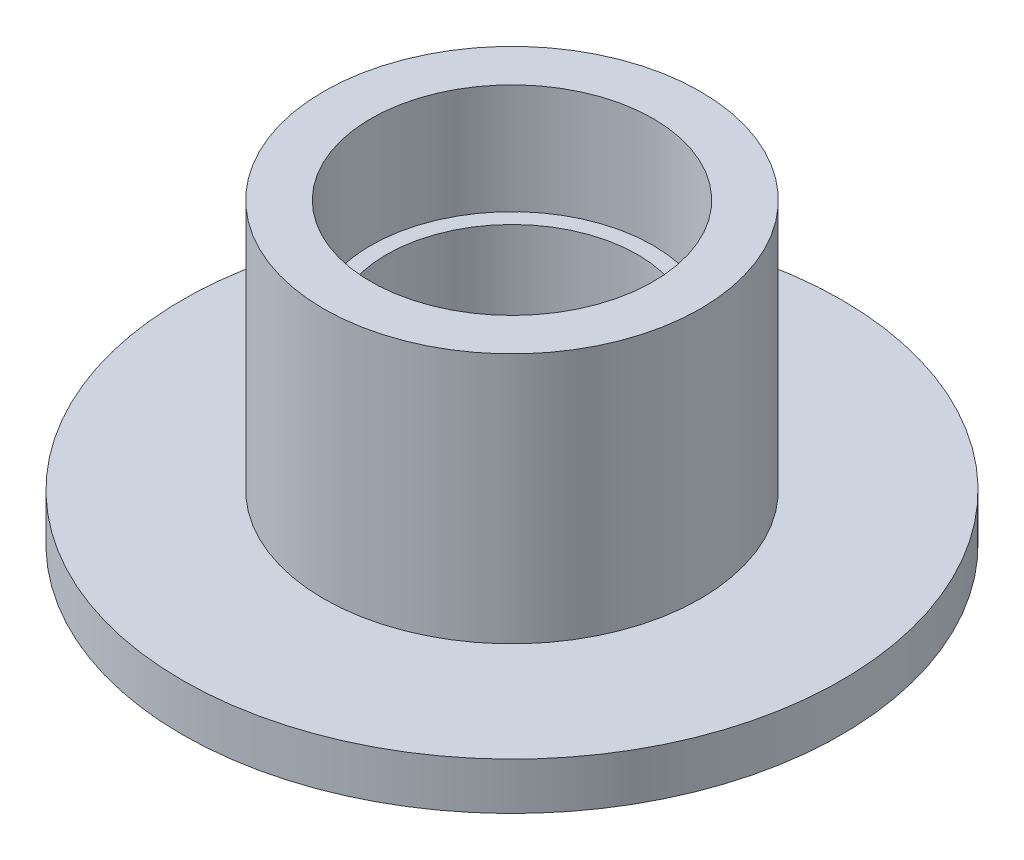
ISO-10303-21;
HEADER;
FILE_DESCRIPTION(('STEP AP214'),'2;1');
FILE_NAME('part.step','',(''),(''),'','','');
FILE_SCHEMA(('AUTOMOTIVE_DESIGN { 1 0 10303 214 1 1 1 1 }'));
ENDSEC;
DATA;
#1=APPLICATION_CONTEXT('core data for automotive mechanical design processes');
#2=APPLICATION_PROTOCOL_DEFINITION('international standard','automotive_design',2000,#1);
#3=PRODUCT_CONTEXT('',#1,'mechanical');
#4=PRODUCT('Part','Part','',(#3));
#5=PRODUCT_RELATED_PRODUCT_CATEGORY('part','',(#4));
#6=PRODUCT_DEFINITION_FORMATION('','',#4);
#7=PRODUCT_DEFINITION_CONTEXT('part definition',#1,'design');
#8=PRODUCT_DEFINITION('design','',#6,#7);
#9=PRODUCT_DEFINITION_SHAPE('','',#8);
#10=(LENGTH_UNIT() NAMED_UNIT(*) SI_UNIT(.MILLI.,.METRE.));
#11=(NAMED_UNIT(*) PLANE_ANGLE_UNIT() SI_UNIT($,.RADIAN.));
#12=(NAMED_UNIT(*) SI_UNIT($,.STERADIAN.) SOLID_ANGLE_UNIT());
#13=UNCERTAINTY_MEASURE_WITH_UNIT(LENGTH_MEASURE(1.E-05),#10,'distance_accuracy_value','');
#14=(GEOMETRIC_REPRESENTATION_CONTEXT(3) GLOBAL_UNCERTAINTY_ASSIGNED_CONTEXT((#13)) GLOBAL_UNIT_ASSIGNED_CONTEXT((#10,
#11,#12)) REPRESENTATION_CONTEXT('',''));
#15=CARTESIAN_POINT('',(0.,0.,0.));
#16=DIRECTION('',(0.,0.,1.));
#17=DIRECTION('',(1.,0.,0.));
#18=AXIS2_PLACEMENT_3D('',#15,#16,#17);
#19=CARTESIAN_POINT('',(-2.,0.,0.));
#20=DIRECTION('',(0.,1.,0.));
#21=DIRECTION('',(0.,0.,1.));
#22=AXIS2_PLACEMENT_3D('',#19,#20,#21);
#23=PLANE('',#22);
#24=CARTESIAN_POINT('',(0.,0.,0.));
#25=DIRECTION('',(0.,-1.,0.));
#26=DIRECTION('',(0.,0.,-1.));
#27=AXIS2_PLACEMENT_3D('',#24,#25,#26);
#28=CIRCLE('',#27,2.);
#29=CARTESIAN_POINT('',(0.,0.,-2.));
#30=VERTEX_POINT('',#29);
#31=EDGE_CURVE('E71',#30,#30,#28,.T.);
#32=ORIENTED_EDGE('',*,*,#31,.F.);
#33=EDGE_LOOP('',(#32));
#34=FACE_BOUND('',#33,.T.);
#35=CARTESIAN_POINT('',(0.,0.,0.));
#36=DIRECTION('',(0.,-1.,0.));
#37=DIRECTION('',(0.,0.,-1.));
#38=AXIS2_PLACEMENT_3D('',#35,#36,#37);
#39=CIRCLE('',#38,3.);
#40=CARTESIAN_POINT('',(0.,0.,-3.));
#41=VERTEX_POINT('',#40);
#42=EDGE_CURVE('E10',#41,#41,#39,.T.);
#43=ORIENTED_EDGE('',*,*,#42,.T.);
#44=EDGE_LOOP('',(#43));
#45=FACE_BOUND('',#44,.T.);
#46=ADVANCED_FACE('F31',(#34,#45),#23,.F.);
#47=CARTESIAN_POINT('',(0.,0.,0.));
#48=DIRECTION('',(0.,-1.,0.));
#49=DIRECTION('',(0.,0.,-1.));
#50=AXIS2_PLACEMENT_3D('',#47,#48,#49);
#51=CYLINDRICAL_SURFACE('',#50,3.);
#52=ORIENTED_EDGE('',*,*,#42,.F.);
#53=EDGE_LOOP('',(#52));
#54=FACE_BOUND('',#53,.T.);
#55=CARTESIAN_POINT('',(0.,3.,0.));
#56=DIRECTION('',(0.,-1.,0.));
#57=DIRECTION('',(0.,0.,-1.));
#58=AXIS2_PLACEMENT_3D('',#55,#56,#57);
#59=CIRCLE('',#58,3.);
#60=CARTESIAN_POINT('',(0.,3.,-3.));
#61=VERTEX_POINT('',#60);
#62=EDGE_CURVE('E37',#61,#61,#59,.T.);
#63=ORIENTED_EDGE('',*,*,#62,.T.);
#64=EDGE_LOOP('',(#63));
#65=FACE_BOUND('',#64,.T.);
#66=ADVANCED_FACE('F78',(#54,#65),#51,.T.);
#67=CARTESIAN_POINT('',(-3.,3.,0.));
#68=DIRECTION('',(0.,1.,0.));
#69=DIRECTION('',(0.,0.,1.));
#70=AXIS2_PLACEMENT_3D('',#67,#68,#69);
#71=PLANE('',#70);
#72=ORIENTED_EDGE('',*,*,#62,.F.);
#73=EDGE_LOOP('',(#72));
#74=FACE_BOUND('',#73,.T.);
#75=CARTESIAN_POINT('',(0.,3.,0.));
#76=DIRECTION('',(0.,-1.,0.));
#77=DIRECTION('',(0.,0.,-1.));
#78=AXIS2_PLACEMENT_3D('',#75,#76,#77);
#79=CIRCLE('',#78,10.5);
#80=CARTESIAN_POINT('',(0.,3.,-10.5));
#81=VERTEX_POINT('',#80);
#82=EDGE_CURVE('E41',#81,#81,#79,.T.);
#83=ORIENTED_EDGE('',*,*,#82,.T.);
#84=EDGE_LOOP('',(#83));
#85=FACE_BOUND('',#84,.T.);
#86=ADVANCED_FACE('F82',(#74,#85),#71,.F.);
#87=CARTESIAN_POINT('',(0.,0.,0.));
#88=DIRECTION('',(0.,-1.,0.));
#89=DIRECTION('',(0.,0.,-1.));
#90=AXIS2_PLACEMENT_3D('',#87,#88,#89);
#91=CYLINDRICAL_SURFACE('',#90,10.5);
#92=ORIENTED_EDGE('',*,*,#82,.F.);
#93=EDGE_LOOP('',(#92));
#94=FACE_BOUND('',#93,.T.);
#95=CARTESIAN_POINT('',(0.,4.5,0.));
#96=DIRECTION('',(0.,-1.,0.));
#97=DIRECTION('',(0.,0.,-1.));
#98=AXIS2_PLACEMENT_3D('',#95,#96,#97);
#99=CIRCLE('',#98,10.5);
#100=CARTESIAN_POINT('',(0.,4.5,-10.5));
#101=VERTEX_POINT('',#100);
#102=EDGE_CURVE('E45',#101,#101,#99,.T.);
#103=ORIENTED_EDGE('',*,*,#102,.T.);
#104=EDGE_LOOP('',(#103));
#105=FACE_BOUND('',#104,.T.);
#106=ADVANCED_FACE('F87',(#94,#105),#91,.T.);
#107=CARTESIAN_POINT('',(-10.5,4.5,0.));
#108=DIRECTION('',(0.,-1.,0.));
#109=DIRECTION('',(0.,0.,-1.));
#110=AXIS2_PLACEMENT_3D('',#107,#108,#109);
#111=PLANE('',#110);
#112=ORIENTED_EDGE('',*,*,#102,.F.);
#113=EDGE_LOOP('',(#112));
#114=FACE_BOUND('',#113,.T.);
#115=CARTESIAN_POINT('',(0.,4.5,0.));
#116=DIRECTION('',(0.,-1.,0.));
#117=DIRECTION('',(0.,0.,-1.));
#118=AXIS2_PLACEMENT_3D('',#115,#116,#117);
#119=CIRCLE('',#118,6.);
#120=CARTESIAN_POINT('',(0.,4.5,-6.));
#121=VERTEX_POINT('',#120);
#122=EDGE_CURVE('E50',#121,#121,#119,.T.);
#123=ORIENTED_EDGE('',*,*,#122,.T.);
#124=EDGE_LOOP('',(#123));
#125=FACE_BOUND('',#124,.T.);
#126=ADVANCED_FACE('F93',(#114,#125),#111,.F.);
#127=CARTESIAN_POINT('',(0.,0.,0.));
#128=DIRECTION('',(0.,-1.,0.));
#129=DIRECTION('',(0.,0.,-1.));
#130=AXIS2_PLACEMENT_3D('',#127,#128,#129);
#131=CYLINDRICAL_SURFACE('',#130,6.);
#132=ORIENTED_EDGE('',*,*,#122,.F.);
#133=EDGE_LOOP('',(#132));
#134=FACE_BOUND('',#133,.T.);
#135=CARTESIAN_POINT('',(0.,12.5,0.));
#136=DIRECTION('',(0.,-1.,0.));
#137=DIRECTION('',(0.,0.,-1.));
#138=AXIS2_PLACEMENT_3D('',#135,#136,#137);
#139=CIRCLE('',#138,6.);
#140=CARTESIAN_POINT('',(0.,12.5,-6.));
#141=VERTEX_POINT('',#140);
#142=EDGE_CURVE('E53',#141,#141,#139,.T.);
#143=ORIENTED_EDGE('',*,*,#142,.T.);
#144=EDGE_LOOP('',(#143));
#145=FACE_BOUND('',#144,.T.);
#146=ADVANCED_FACE('F97',(#134,#145),#131,.T.);
#147=CARTESIAN_POINT('',(-6.,12.5,0.));
#148=DIRECTION('',(0.,-1.,0.));
#149=DIRECTION('',(0.,0.,-1.));
#150=AXIS2_PLACEMENT_3D('',#147,#148,#149);
#151=PLANE('',#150);
#152=ORIENTED_EDGE('',*,*,#142,.F.);
#153=EDGE_LOOP('',(#152));
#154=FACE_BOUND('',#153,.T.);
#155=CARTESIAN_POINT('',(0.,12.5,0.));
#156=DIRECTION('',(0.,-1.,0.));
#157=DIRECTION('',(0.,0.,-1.));
#158=AXIS2_PLACEMENT_3D('',#155,#156,#157);
#159=CIRCLE('',#158,4.5);
#160=CARTESIAN_POINT('',(0.,12.5,-4.5));
#161=VERTEX_POINT('',#160);
#162=EDGE_CURVE('E56',#161,#161,#159,.T.);
#163=ORIENTED_EDGE('',*,*,#162,.T.);
#164=EDGE_LOOP('',(#163));
#165=FACE_BOUND('',#164,.T.);
#166=ADVANCED_FACE('F101',(#154,#165),#151,.F.);
#167=CARTESIAN_POINT('',(0.,0.,0.));
#168=DIRECTION('',(0.,-1.,0.));
#169=DIRECTION('',(0.,0.,-1.));
#170=AXIS2_PLACEMENT_3D('',#167,#168,#169);
#171=CYLINDRICAL_SURFACE('',#170,4.5);
#172=ORIENTED_EDGE('',*,*,#162,.F.);
#173=EDGE_LOOP('',(#172));
#174=FACE_BOUND('',#173,.T.);
#175=CARTESIAN_POINT('',(0.,9.,0.));
#176=DIRECTION('',(0.,-1.,0.));
#177=DIRECTION('',(0.,0.,-1.));
#178=AXIS2_PLACEMENT_3D('',#175,#176,#177);
#179=CIRCLE('',#178,4.5);
#180=CARTESIAN_POINT('',(0.,9.,-4.5));
#181=VERTEX_POINT('',#180);
#182=EDGE_CURVE('E59',#181,#181,#179,.T.);
#183=ORIENTED_EDGE('',*,*,#182,.T.);
#184=EDGE_LOOP('',(#183));
#185=FACE_BOUND('',#184,.T.);
#186=ADVANCED_FACE('F105',(#174,#185),#171,.F.);
#187=CARTESIAN_POINT('',(-4.5,9.,0.));
#188=DIRECTION('',(0.,-1.,0.));
#189=DIRECTION('',(0.,0.,-1.));
#190=AXIS2_PLACEMENT_3D('',#187,#188,#189);
#191=PLANE('',#190);
#192=ORIENTED_EDGE('',*,*,#182,.F.);
#193=EDGE_LOOP('',(#192));
#194=FACE_BOUND('',#193,.T.);
#195=CARTESIAN_POINT('',(0.,9.,0.));
#196=DIRECTION('',(0.,-1.,0.));
#197=DIRECTION('',(0.,0.,-1.));
#198=AXIS2_PLACEMENT_3D('',#195,#196,#197);
#199=CIRCLE('',#198,4.);
#200=CARTESIAN_POINT('',(0.,9.,-4.));
#201=VERTEX_POINT('',#200);
#202=EDGE_CURVE('E62',#201,#201,#199,.T.);
#203=ORIENTED_EDGE('',*,*,#202,.T.);
#204=EDGE_LOOP('',(#203));
#205=FACE_BOUND('',#204,.T.);
#206=ADVANCED_FACE('F109',(#194,#205),#191,.F.);
#207=CARTESIAN_POINT('',(0.,0.,0.));
#208=DIRECTION('',(0.,-1.,0.));
#209=DIRECTION('',(0.,0.,-1.));
#210=AXIS2_PLACEMENT_3D('',#207,#208,#209);
#211=CYLINDRICAL_SURFACE('',#210,4.);
#212=ORIENTED_EDGE('',*,*,#202,.F.);
#213=EDGE_LOOP('',(#212));
#214=FACE_BOUND('',#213,.T.);
#215=CARTESIAN_POINT('',(0.,5.,0.));
#216=DIRECTION('',(0.,-1.,0.));
#217=DIRECTION('',(0.,0.,-1.));
#218=AXIS2_PLACEMENT_3D('',#215,#216,#217);
#219=CIRCLE('',#218,4.);
#220=CARTESIAN_POINT('',(0.,5.,-4.));
#221=VERTEX_POINT('',#220);
#222=EDGE_CURVE('E65',#221,#221,#219,.T.);
#223=ORIENTED_EDGE('',*,*,#222,.T.);
#224=EDGE_LOOP('',(#223));
#225=FACE_BOUND('',#224,.T.);
#226=ADVANCED_FACE('F113',(#214,#225),#211,.F.);
#227=CARTESIAN_POINT('',(0.,3.84529946162076,0.));
#228=DIRECTION('',(0.,1.,0.));
#229=DIRECTION('',(0.,0.,1.));
#230=AXIS2_PLACEMENT_3D('',#227,#228,#229);
#231=CONICAL_SURFACE('',#230,2.,1.0471975511966);
#232=ORIENTED_EDGE('',*,*,#222,.F.);
#233=EDGE_LOOP('',(#232));
#234=FACE_BOUND('',#233,.T.);
#235=CARTESIAN_POINT('',(0.,3.84529946162076,0.));
#236=DIRECTION('',(0.,-1.,0.));
#237=DIRECTION('',(0.,0.,-1.));
#238=AXIS2_PLACEMENT_3D('',#235,#236,#237);
#239=CIRCLE('',#238,2.);
#240=CARTESIAN_POINT('',(0.,3.84529946162076,-2.));
#241=VERTEX_POINT('',#240);
#242=EDGE_CURVE('E68',#241,#241,#239,.T.);
#243=ORIENTED_EDGE('',*,*,#242,.T.);
#244=EDGE_LOOP('',(#243));
#245=FACE_BOUND('',#244,.T.);
#246=ADVANCED_FACE('F117',(#234,#245),#231,.F.);
#247=CARTESIAN_POINT('',(0.,0.,0.));
#248=DIRECTION('',(0.,-1.,0.));
#249=DIRECTION('',(0.,0.,-1.));
#250=AXIS2_PLACEMENT_3D('',#247,#248,#249);
#251=CYLINDRICAL_SURFACE('',#250,2.);
#252=ORIENTED_EDGE('',*,*,#242,.F.);
#253=EDGE_LOOP('',(#252));
#254=FACE_BOUND('',#253,.T.);
#255=ORIENTED_EDGE('',*,*,#31,.T.);
#256=EDGE_LOOP('',(#255));
#257=FACE_BOUND('',#256,.T.);
#258=ADVANCED_FACE('F75',(#254,#257),#251,.F.);
#259=CLOSED_SHELL('',(#46,#66,#86,#106,#126,#146,#166,#186,#206,#226,#246,#258));
#260=MANIFOLD_SOLID_BREP('B2',#259);
#261=ADVANCED_BREP_SHAPE_REPRESENTATION('',(#18,#260),#14);
#262=SHAPE_DEFINITION_REPRESENTATION(#9,#261);
ENDSEC;
END-ISO-10303-21;
